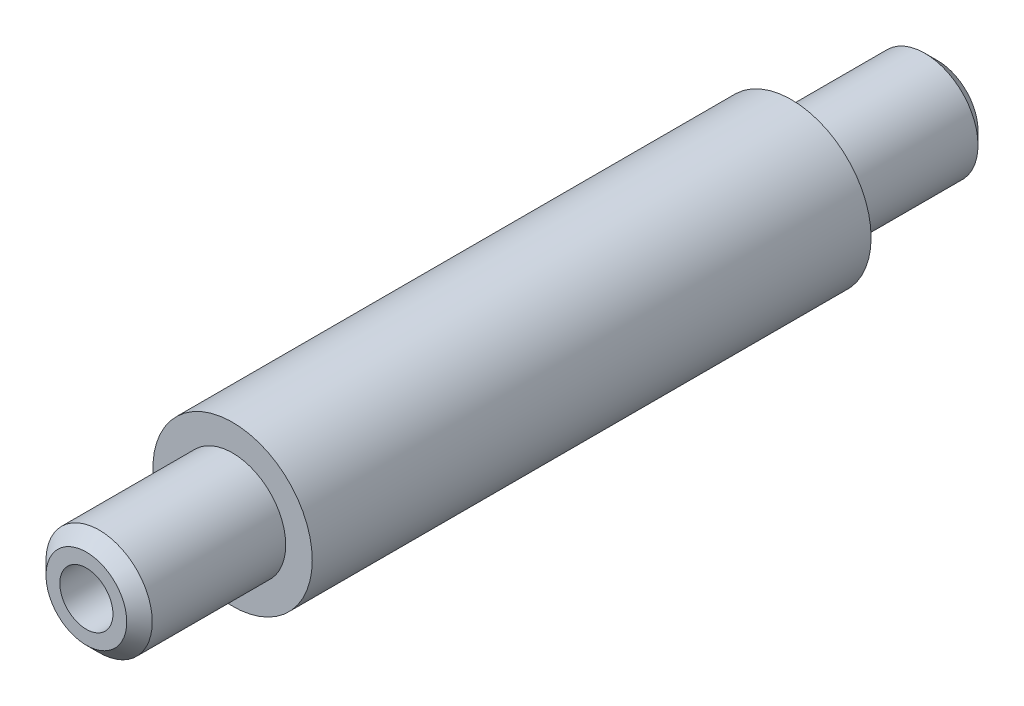
ISO-10303-21;
HEADER;
FILE_DESCRIPTION(('STEP AP214'),'2;1');
FILE_NAME('part.step','',(''),(''),'','','');
FILE_SCHEMA(('AUTOMOTIVE_DESIGN { 1 0 10303 214 1 1 1 1 }'));
ENDSEC;
DATA;
#1=APPLICATION_CONTEXT('core data for automotive mechanical design processes');
#2=APPLICATION_PROTOCOL_DEFINITION('international standard','automotive_design',2000,#1);
#3=PRODUCT_CONTEXT('',#1,'mechanical');
#4=PRODUCT('Part','Part','',(#3));
#5=PRODUCT_RELATED_PRODUCT_CATEGORY('part','',(#4));
#6=PRODUCT_DEFINITION_FORMATION('','',#4);
#7=PRODUCT_DEFINITION_CONTEXT('part definition',#1,'design');
#8=PRODUCT_DEFINITION('design','',#6,#7);
#9=PRODUCT_DEFINITION_SHAPE('','',#8);
#10=(LENGTH_UNIT() NAMED_UNIT(*) SI_UNIT(.MILLI.,.METRE.));
#11=(NAMED_UNIT(*) PLANE_ANGLE_UNIT() SI_UNIT($,.RADIAN.));
#12=(NAMED_UNIT(*) SI_UNIT($,.STERADIAN.) SOLID_ANGLE_UNIT());
#13=UNCERTAINTY_MEASURE_WITH_UNIT(LENGTH_MEASURE(1.E-05),#10,'distance_accuracy_value','');
#14=(GEOMETRIC_REPRESENTATION_CONTEXT(3) GLOBAL_UNCERTAINTY_ASSIGNED_CONTEXT((#13)) GLOBAL_UNIT_ASSIGNED_CONTEXT((#10,
#11,#12)) REPRESENTATION_CONTEXT('',''));
#15=CARTESIAN_POINT('',(0.,0.,0.));
#16=DIRECTION('',(0.,0.,1.));
#17=DIRECTION('',(1.,0.,0.));
#18=AXIS2_PLACEMENT_3D('',#15,#16,#17);
#19=CARTESIAN_POINT('',(0.,4.826,0.152399999999983));
#20=DIRECTION('',(0.,0.,-1.));
#21=DIRECTION('',(-1.,0.,0.));
#22=AXIS2_PLACEMENT_3D('',#19,#20,#21);
#23=PLANE('',#22);
#24=CARTESIAN_POINT('',(0.,0.,0.152399999999983));
#25=DIRECTION('',(0.,0.,1.));
#26=DIRECTION('',(1.,0.,0.));
#27=AXIS2_PLACEMENT_3D('',#24,#25,#26);
#28=CIRCLE('',#27,3.175);
#29=CARTESIAN_POINT('',(3.175,0.,0.152399999999983));
#30=VERTEX_POINT('',#29);
#31=EDGE_CURVE('E10',#30,#30,#28,.T.);
#32=ORIENTED_EDGE('',*,*,#31,.F.);
#33=EDGE_LOOP('',(#32));
#34=FACE_BOUND('',#33,.T.);
#35=CARTESIAN_POINT('',(0.,0.,0.152399999999983));
#36=DIRECTION('',(0.,0.,1.));
#37=DIRECTION('',(1.,0.,0.));
#38=AXIS2_PLACEMENT_3D('',#35,#36,#37);
#39=CIRCLE('',#38,4.826);
#40=CARTESIAN_POINT('',(4.826,0.,0.152399999999983));
#41=VERTEX_POINT('',#40);
#42=EDGE_CURVE('E84',#41,#41,#39,.T.);
#43=ORIENTED_EDGE('',*,*,#42,.T.);
#44=EDGE_LOOP('',(#43));
#45=FACE_BOUND('',#44,.T.);
#46=ADVANCED_FACE('F39',(#34,#45),#23,.F.);
#47=CARTESIAN_POINT('',(0.,0.,0.));
#48=DIRECTION('',(0.,0.,1.));
#49=DIRECTION('',(1.,0.,0.));
#50=AXIS2_PLACEMENT_3D('',#47,#48,#49);
#51=CYLINDRICAL_SURFACE('',#50,3.175);
#52=CARTESIAN_POINT('',(0.,0.,-101.6));
#53=DIRECTION('',(0.,0.,1.));
#54=DIRECTION('',(1.,0.,0.));
#55=AXIS2_PLACEMENT_3D('',#52,#53,#54);
#56=CIRCLE('',#55,3.175);
#57=CARTESIAN_POINT('',(3.175,0.,-101.6));
#58=VERTEX_POINT('',#57);
#59=EDGE_CURVE('E46',#58,#58,#56,.T.);
#60=ORIENTED_EDGE('',*,*,#59,.F.);
#61=EDGE_LOOP('',(#60));
#62=FACE_BOUND('',#61,.T.);
#63=ORIENTED_EDGE('',*,*,#31,.T.);
#64=EDGE_LOOP('',(#63));
#65=FACE_BOUND('',#64,.T.);
#66=ADVANCED_FACE('F135',(#62,#65),#51,.F.);
#67=CARTESIAN_POINT('',(0.,3.175,-101.6));
#68=DIRECTION('',(0.,0.,1.));
#69=DIRECTION('',(1.,0.,0.));
#70=AXIS2_PLACEMENT_3D('',#67,#68,#69);
#71=PLANE('',#70);
#72=CARTESIAN_POINT('',(0.,0.,-101.6));
#73=DIRECTION('',(0.,0.,1.));
#74=DIRECTION('',(1.,0.,0.));
#75=AXIS2_PLACEMENT_3D('',#72,#73,#74);
#76=CIRCLE('',#75,4.826);
#77=CARTESIAN_POINT('',(4.826,0.,-101.6));
#78=VERTEX_POINT('',#77);
#79=EDGE_CURVE('E52',#78,#78,#76,.T.);
#80=ORIENTED_EDGE('',*,*,#79,.F.);
#81=EDGE_LOOP('',(#80));
#82=FACE_BOUND('',#81,.T.);
#83=ORIENTED_EDGE('',*,*,#59,.T.);
#84=EDGE_LOOP('',(#83));
#85=FACE_BOUND('',#84,.T.);
#86=ADVANCED_FACE('F130',(#82,#85),#71,.F.);
#87=CARTESIAN_POINT('',(0.,0.,-101.6));
#88=DIRECTION('',(0.,0.,1.));
#89=DIRECTION('',(1.,0.,0.));
#90=AXIS2_PLACEMENT_3D('',#87,#88,#89);
#91=CONICAL_SURFACE('',#90,4.826,0.785398163397449);
#92=CARTESIAN_POINT('',(0.,0.,-100.076));
#93=DIRECTION('',(0.,0.,1.));
#94=DIRECTION('',(1.,0.,0.));
#95=AXIS2_PLACEMENT_3D('',#92,#93,#94);
#96=CIRCLE('',#95,6.35);
#97=CARTESIAN_POINT('',(6.35,0.,-100.076));
#98=VERTEX_POINT('',#97);
#99=EDGE_CURVE('E58',#98,#98,#96,.T.);
#100=ORIENTED_EDGE('',*,*,#99,.F.);
#101=EDGE_LOOP('',(#100));
#102=FACE_BOUND('',#101,.T.);
#103=ORIENTED_EDGE('',*,*,#79,.T.);
#104=EDGE_LOOP('',(#103));
#105=FACE_BOUND('',#104,.T.);
#106=ADVANCED_FACE('F124',(#102,#105),#91,.T.);
#107=CARTESIAN_POINT('',(0.,0.,0.));
#108=DIRECTION('',(0.,0.,1.));
#109=DIRECTION('',(1.,0.,0.));
#110=AXIS2_PLACEMENT_3D('',#107,#108,#109);
#111=CYLINDRICAL_SURFACE('',#110,6.35);
#112=CARTESIAN_POINT('',(0.,0.,-84.1248));
#113=DIRECTION('',(0.,0.,1.));
#114=DIRECTION('',(1.,0.,0.));
#115=AXIS2_PLACEMENT_3D('',#112,#113,#114);
#116=CIRCLE('',#115,6.35);
#117=CARTESIAN_POINT('',(6.35,0.,-84.1248));
#118=VERTEX_POINT('',#117);
#119=EDGE_CURVE('E64',#118,#118,#116,.T.);
#120=ORIENTED_EDGE('',*,*,#119,.F.);
#121=EDGE_LOOP('',(#120));
#122=FACE_BOUND('',#121,.T.);
#123=ORIENTED_EDGE('',*,*,#99,.T.);
#124=EDGE_LOOP('',(#123));
#125=FACE_BOUND('',#124,.T.);
#126=ADVANCED_FACE('F118',(#122,#125),#111,.T.);
#127=CARTESIAN_POINT('',(0.,6.35,-84.1248));
#128=DIRECTION('',(0.,0.,1.));
#129=DIRECTION('',(1.,0.,0.));
#130=AXIS2_PLACEMENT_3D('',#127,#128,#129);
#131=PLANE('',#130);
#132=CARTESIAN_POINT('',(0.,0.,-84.1248));
#133=DIRECTION('',(0.,0.,1.));
#134=DIRECTION('',(1.,0.,0.));
#135=AXIS2_PLACEMENT_3D('',#132,#133,#134);
#136=CIRCLE('',#135,9.525);
#137=CARTESIAN_POINT('',(9.525,0.,-84.1248));
#138=VERTEX_POINT('',#137);
#139=EDGE_CURVE('E68',#138,#138,#136,.T.);
#140=ORIENTED_EDGE('',*,*,#139,.F.);
#141=EDGE_LOOP('',(#140));
#142=FACE_BOUND('',#141,.T.);
#143=ORIENTED_EDGE('',*,*,#119,.T.);
#144=EDGE_LOOP('',(#143));
#145=FACE_BOUND('',#144,.T.);
#146=ADVANCED_FACE('F112',(#142,#145),#131,.F.);
#147=CARTESIAN_POINT('',(0.,0.,0.));
#148=DIRECTION('',(0.,0.,1.));
#149=DIRECTION('',(1.,0.,0.));
#150=AXIS2_PLACEMENT_3D('',#147,#148,#149);
#151=CYLINDRICAL_SURFACE('',#150,9.525);
#152=CARTESIAN_POINT('',(0.,0.,-17.3228));
#153=DIRECTION('',(0.,0.,1.));
#154=DIRECTION('',(1.,0.,0.));
#155=AXIS2_PLACEMENT_3D('',#152,#153,#154);
#156=CIRCLE('',#155,9.52499999999999);
#157=CARTESIAN_POINT('',(9.52499999999999,0.,-17.3228));
#158=VERTEX_POINT('',#157);
#159=EDGE_CURVE('E72',#158,#158,#156,.T.);
#160=ORIENTED_EDGE('',*,*,#159,.F.);
#161=EDGE_LOOP('',(#160));
#162=FACE_BOUND('',#161,.T.);
#163=ORIENTED_EDGE('',*,*,#139,.T.);
#164=EDGE_LOOP('',(#163));
#165=FACE_BOUND('',#164,.T.);
#166=ADVANCED_FACE('F106',(#162,#165),#151,.T.);
#167=CARTESIAN_POINT('',(0.,9.52499999999999,-17.3228));
#168=DIRECTION('',(0.,0.,-1.));
#169=DIRECTION('',(-1.,0.,0.));
#170=AXIS2_PLACEMENT_3D('',#167,#168,#169);
#171=PLANE('',#170);
#172=CARTESIAN_POINT('',(0.,0.,-17.3228));
#173=DIRECTION('',(0.,0.,1.));
#174=DIRECTION('',(1.,0.,0.));
#175=AXIS2_PLACEMENT_3D('',#172,#173,#174);
#176=CIRCLE('',#175,6.35);
#177=CARTESIAN_POINT('',(6.35,0.,-17.3228));
#178=VERTEX_POINT('',#177);
#179=EDGE_CURVE('E76',#178,#178,#176,.T.);
#180=ORIENTED_EDGE('',*,*,#179,.F.);
#181=EDGE_LOOP('',(#180));
#182=FACE_BOUND('',#181,.T.);
#183=ORIENTED_EDGE('',*,*,#159,.T.);
#184=EDGE_LOOP('',(#183));
#185=FACE_BOUND('',#184,.T.);
#186=ADVANCED_FACE('F100',(#182,#185),#171,.F.);
#187=CARTESIAN_POINT('',(0.,0.,0.));
#188=DIRECTION('',(0.,0.,1.));
#189=DIRECTION('',(1.,0.,0.));
#190=AXIS2_PLACEMENT_3D('',#187,#188,#189);
#191=CYLINDRICAL_SURFACE('',#190,6.35);
#192=CARTESIAN_POINT('',(0.,0.,-1.37160000000002));
#193=DIRECTION('',(0.,0.,1.));
#194=DIRECTION('',(1.,0.,0.));
#195=AXIS2_PLACEMENT_3D('',#192,#193,#194);
#196=CIRCLE('',#195,6.35);
#197=CARTESIAN_POINT('',(6.35,0.,-1.37160000000002));
#198=VERTEX_POINT('',#197);
#199=EDGE_CURVE('E80',#198,#198,#196,.T.);
#200=ORIENTED_EDGE('',*,*,#199,.F.);
#201=EDGE_LOOP('',(#200));
#202=FACE_BOUND('',#201,.T.);
#203=ORIENTED_EDGE('',*,*,#179,.T.);
#204=EDGE_LOOP('',(#203));
#205=FACE_BOUND('',#204,.T.);
#206=ADVANCED_FACE('F94',(#202,#205),#191,.T.);
#207=CARTESIAN_POINT('',(0.,0.,-1.37160000000002));
#208=DIRECTION('',(0.,0.,-1.));
#209=DIRECTION('',(-1.,0.,0.));
#210=AXIS2_PLACEMENT_3D('',#207,#208,#209);
#211=CONICAL_SURFACE('',#210,6.35,0.785398163397449);
#212=ORIENTED_EDGE('',*,*,#42,.F.);
#213=EDGE_LOOP('',(#212));
#214=FACE_BOUND('',#213,.T.);
#215=ORIENTED_EDGE('',*,*,#199,.T.);
#216=EDGE_LOOP('',(#215));
#217=FACE_BOUND('',#216,.T.);
#218=ADVANCED_FACE('F91',(#214,#217),#211,.T.);
#219=CLOSED_SHELL('',(#46,#66,#86,#106,#126,#146,#166,#186,#206,#218));
#220=MANIFOLD_SOLID_BREP('B2',#219);
#221=ADVANCED_BREP_SHAPE_REPRESENTATION('',(#18,#220),#14);
#222=SHAPE_DEFINITION_REPRESENTATION(#9,#221);
ENDSEC;
END-ISO-10303-21;
